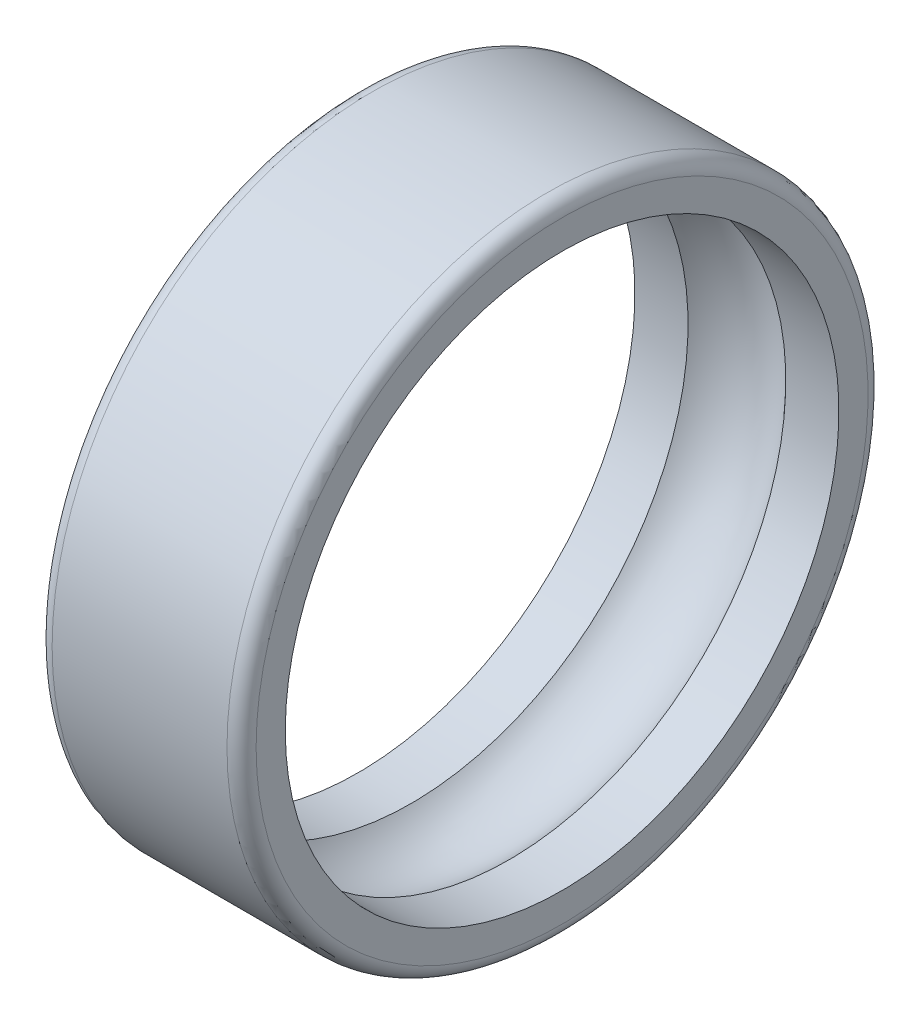
ISO-10303-21;
HEADER;
FILE_DESCRIPTION(('STEP AP214'),'2;1');
FILE_NAME('part.step','',(''),(''),'','','');
FILE_SCHEMA(('AUTOMOTIVE_DESIGN { 1 0 10303 214 1 1 1 1 }'));
ENDSEC;
DATA;
#1=APPLICATION_CONTEXT('core data for automotive mechanical design processes');
#2=APPLICATION_PROTOCOL_DEFINITION('international standard','automotive_design',2000,#1);
#3=PRODUCT_CONTEXT('',#1,'mechanical');
#4=PRODUCT('Part','Part','',(#3));
#5=PRODUCT_RELATED_PRODUCT_CATEGORY('part','',(#4));
#6=PRODUCT_DEFINITION_FORMATION('','',#4);
#7=PRODUCT_DEFINITION_CONTEXT('part definition',#1,'design');
#8=PRODUCT_DEFINITION('design','',#6,#7);
#9=PRODUCT_DEFINITION_SHAPE('','',#8);
#10=(LENGTH_UNIT() NAMED_UNIT(*) SI_UNIT(.MILLI.,.METRE.));
#11=(NAMED_UNIT(*) PLANE_ANGLE_UNIT() SI_UNIT($,.RADIAN.));
#12=(NAMED_UNIT(*) SI_UNIT($,.STERADIAN.) SOLID_ANGLE_UNIT());
#13=UNCERTAINTY_MEASURE_WITH_UNIT(LENGTH_MEASURE(1.E-05),#10,'distance_accuracy_value','');
#14=(GEOMETRIC_REPRESENTATION_CONTEXT(3) GLOBAL_UNCERTAINTY_ASSIGNED_CONTEXT((#13)) GLOBAL_UNIT_ASSIGNED_CONTEXT((#10,
#11,#12)) REPRESENTATION_CONTEXT('',''));
#15=CARTESIAN_POINT('',(0.,0.,0.));
#16=DIRECTION('',(0.,0.,1.));
#17=DIRECTION('',(1.,0.,0.));
#18=AXIS2_PLACEMENT_3D('',#15,#16,#17);
#19=CARTESIAN_POINT('',(-3.5,9.5,0.));
#20=DIRECTION('',(1.,0.,0.));
#21=DIRECTION('',(0.,0.,-1.));
#22=AXIS2_PLACEMENT_3D('',#19,#20,#21);
#23=PLANE('',#22);
#24=CARTESIAN_POINT('',(-3.5,0.,0.));
#25=DIRECTION('',(1.,0.,0.));
#26=DIRECTION('',(0.,0.,-1.));
#27=AXIS2_PLACEMENT_3D('',#24,#25,#26);
#28=CIRCLE('',#27,10.5);
#29=CARTESIAN_POINT('',(-3.5,0.,-10.5));
#30=VERTEX_POINT('',#29);
#31=EDGE_CURVE('E10',#30,#30,#28,.F.);
#32=ORIENTED_EDGE('',*,*,#31,.T.);
#33=EDGE_LOOP('',(#32));
#34=FACE_BOUND('',#33,.T.);
#35=CARTESIAN_POINT('',(-3.5,0.,0.));
#36=DIRECTION('',(-1.,0.,0.));
#37=DIRECTION('',(0.,0.,1.));
#38=AXIS2_PLACEMENT_3D('',#35,#36,#37);
#39=CIRCLE('',#38,9.5);
#40=CARTESIAN_POINT('',(-3.5,0.,9.5));
#41=VERTEX_POINT('',#40);
#42=EDGE_CURVE('E66',#41,#41,#39,.T.);
#43=ORIENTED_EDGE('',*,*,#42,.F.);
#44=EDGE_LOOP('',(#43));
#45=FACE_BOUND('',#44,.T.);
#46=ADVANCED_FACE('F37',(#34,#45),#23,.F.);
#47=CARTESIAN_POINT('',(-29.8425925925926,0.,0.));
#48=DIRECTION('',(-1.,0.,0.));
#49=DIRECTION('',(0.,0.,1.));
#50=AXIS2_PLACEMENT_3D('',#47,#48,#49);
#51=CYLINDRICAL_SURFACE('',#50,11.);
#52=CARTESIAN_POINT('',(3.,0.,0.));
#53=DIRECTION('',(-1.,0.,0.));
#54=DIRECTION('',(0.,0.,1.));
#55=AXIS2_PLACEMENT_3D('',#52,#53,#54);
#56=CIRCLE('',#55,11.);
#57=CARTESIAN_POINT('',(3.,0.,11.));
#58=VERTEX_POINT('',#57);
#59=EDGE_CURVE('E48',#58,#58,#56,.T.);
#60=ORIENTED_EDGE('',*,*,#59,.T.);
#61=EDGE_LOOP('',(#60));
#62=FACE_BOUND('',#61,.T.);
#63=CARTESIAN_POINT('',(-3.,0.,0.));
#64=DIRECTION('',(1.,0.,0.));
#65=DIRECTION('',(0.,0.,-1.));
#66=AXIS2_PLACEMENT_3D('',#63,#64,#65);
#67=CIRCLE('',#66,11.);
#68=CARTESIAN_POINT('',(-3.,0.,-11.));
#69=VERTEX_POINT('',#68);
#70=EDGE_CURVE('E52',#69,#69,#67,.T.);
#71=ORIENTED_EDGE('',*,*,#70,.T.);
#72=EDGE_LOOP('',(#71));
#73=FACE_BOUND('',#72,.T.);
#74=ADVANCED_FACE('F73',(#62,#73),#51,.T.);
#75=CARTESIAN_POINT('',(3.5,9.5,0.));
#76=DIRECTION('',(-1.,0.,0.));
#77=DIRECTION('',(0.,0.,1.));
#78=AXIS2_PLACEMENT_3D('',#75,#76,#77);
#79=PLANE('',#78);
#80=CARTESIAN_POINT('',(3.5,0.,0.));
#81=DIRECTION('',(-1.,0.,0.));
#82=DIRECTION('',(0.,0.,1.));
#83=AXIS2_PLACEMENT_3D('',#80,#81,#82);
#84=CIRCLE('',#83,10.5);
#85=CARTESIAN_POINT('',(3.5,0.,10.5));
#86=VERTEX_POINT('',#85);
#87=EDGE_CURVE('E44',#86,#86,#84,.F.);
#88=ORIENTED_EDGE('',*,*,#87,.T.);
#89=EDGE_LOOP('',(#88));
#90=FACE_BOUND('',#89,.T.);
#91=CARTESIAN_POINT('',(3.5,0.,0.));
#92=DIRECTION('',(-1.,0.,0.));
#93=DIRECTION('',(0.,0.,1.));
#94=AXIS2_PLACEMENT_3D('',#91,#92,#93);
#95=CIRCLE('',#94,9.5);
#96=CARTESIAN_POINT('',(3.5,0.,9.5));
#97=VERTEX_POINT('',#96);
#98=EDGE_CURVE('E57',#97,#97,#95,.T.);
#99=ORIENTED_EDGE('',*,*,#98,.T.);
#100=EDGE_LOOP('',(#99));
#101=FACE_BOUND('',#100,.T.);
#102=ADVANCED_FACE('F78',(#90,#101),#79,.F.);
#103=CARTESIAN_POINT('',(-29.8425925925926,0.,0.));
#104=DIRECTION('',(-1.,0.,0.));
#105=DIRECTION('',(0.,0.,1.));
#106=AXIS2_PLACEMENT_3D('',#103,#104,#105);
#107=CYLINDRICAL_SURFACE('',#106,9.5);
#108=ORIENTED_EDGE('',*,*,#98,.F.);
#109=EDGE_LOOP('',(#108));
#110=FACE_BOUND('',#109,.T.);
#111=CARTESIAN_POINT('',(1.67705098312484,0.,0.));
#112=DIRECTION('',(-1.,0.,0.));
#113=DIRECTION('',(0.,0.,1.));
#114=AXIS2_PLACEMENT_3D('',#111,#112,#113);
#115=CIRCLE('',#114,9.5);
#116=CARTESIAN_POINT('',(1.67705098312484,0.,9.5));
#117=VERTEX_POINT('',#116);
#118=EDGE_CURVE('E60',#117,#117,#115,.T.);
#119=ORIENTED_EDGE('',*,*,#118,.T.);
#120=EDGE_LOOP('',(#119));
#121=FACE_BOUND('',#120,.T.);
#122=ADVANCED_FACE('F101',(#110,#121),#107,.F.);
#123=CARTESIAN_POINT('',(0.,0.,0.));
#124=DIRECTION('',(-1.,0.,0.));
#125=DIRECTION('',(0.,0.,1.));
#126=AXIS2_PLACEMENT_3D('',#123,#124,#125);
#127=TOROIDAL_SURFACE('',#126,8.,2.25);
#128=ORIENTED_EDGE('',*,*,#118,.F.);
#129=EDGE_LOOP('',(#128));
#130=FACE_BOUND('',#129,.T.);
#131=CARTESIAN_POINT('',(-1.67705098312484,0.,0.));
#132=DIRECTION('',(-1.,0.,0.));
#133=DIRECTION('',(0.,0.,1.));
#134=AXIS2_PLACEMENT_3D('',#131,#132,#133);
#135=CIRCLE('',#134,9.5);
#136=CARTESIAN_POINT('',(-1.67705098312484,0.,9.5));
#137=VERTEX_POINT('',#136);
#138=EDGE_CURVE('E63',#137,#137,#135,.T.);
#139=ORIENTED_EDGE('',*,*,#138,.T.);
#140=EDGE_LOOP('',(#139));
#141=FACE_BOUND('',#140,.T.);
#142=ADVANCED_FACE('F90',(#130,#141),#127,.F.);
#143=CARTESIAN_POINT('',(-29.8425925925926,0.,0.));
#144=DIRECTION('',(-1.,0.,0.));
#145=DIRECTION('',(0.,0.,1.));
#146=AXIS2_PLACEMENT_3D('',#143,#144,#145);
#147=CYLINDRICAL_SURFACE('',#146,9.5);
#148=ORIENTED_EDGE('',*,*,#138,.F.);
#149=EDGE_LOOP('',(#148));
#150=FACE_BOUND('',#149,.T.);
#151=ORIENTED_EDGE('',*,*,#42,.T.);
#152=EDGE_LOOP('',(#151));
#153=FACE_BOUND('',#152,.T.);
#154=ADVANCED_FACE('F70',(#150,#153),#147,.F.);
#155=CARTESIAN_POINT('',(3.,0.,0.));
#156=DIRECTION('',(-1.,0.,0.));
#157=DIRECTION('',(0.,0.,1.));
#158=AXIS2_PLACEMENT_3D('',#155,#156,#157);
#159=TOROIDAL_SURFACE('',#158,10.5,0.5);
#160=ORIENTED_EDGE('',*,*,#87,.F.);
#161=EDGE_LOOP('',(#160));
#162=FACE_BOUND('',#161,.T.);
#163=ORIENTED_EDGE('',*,*,#59,.F.);
#164=EDGE_LOOP('',(#163));
#165=FACE_BOUND('',#164,.T.);
#166=ADVANCED_FACE('F82',(#162,#165),#159,.T.);
#167=CARTESIAN_POINT('',(-3.,0.,0.));
#168=DIRECTION('',(1.,0.,0.));
#169=DIRECTION('',(0.,0.,-1.));
#170=AXIS2_PLACEMENT_3D('',#167,#168,#169);
#171=TOROIDAL_SURFACE('',#170,10.5,0.5);
#172=ORIENTED_EDGE('',*,*,#70,.F.);
#173=EDGE_LOOP('',(#172));
#174=FACE_BOUND('',#173,.T.);
#175=ORIENTED_EDGE('',*,*,#31,.F.);
#176=EDGE_LOOP('',(#175));
#177=FACE_BOUND('',#176,.T.);
#178=ADVANCED_FACE('F39',(#174,#177),#171,.T.);
#179=CLOSED_SHELL('',(#46,#74,#102,#122,#142,#154,#166,#178));
#180=MANIFOLD_SOLID_BREP('B2',#179);
#181=ADVANCED_BREP_SHAPE_REPRESENTATION('',(#18,#180),#14);
#182=SHAPE_DEFINITION_REPRESENTATION(#9,#181);
ENDSEC;
END-ISO-10303-21;
